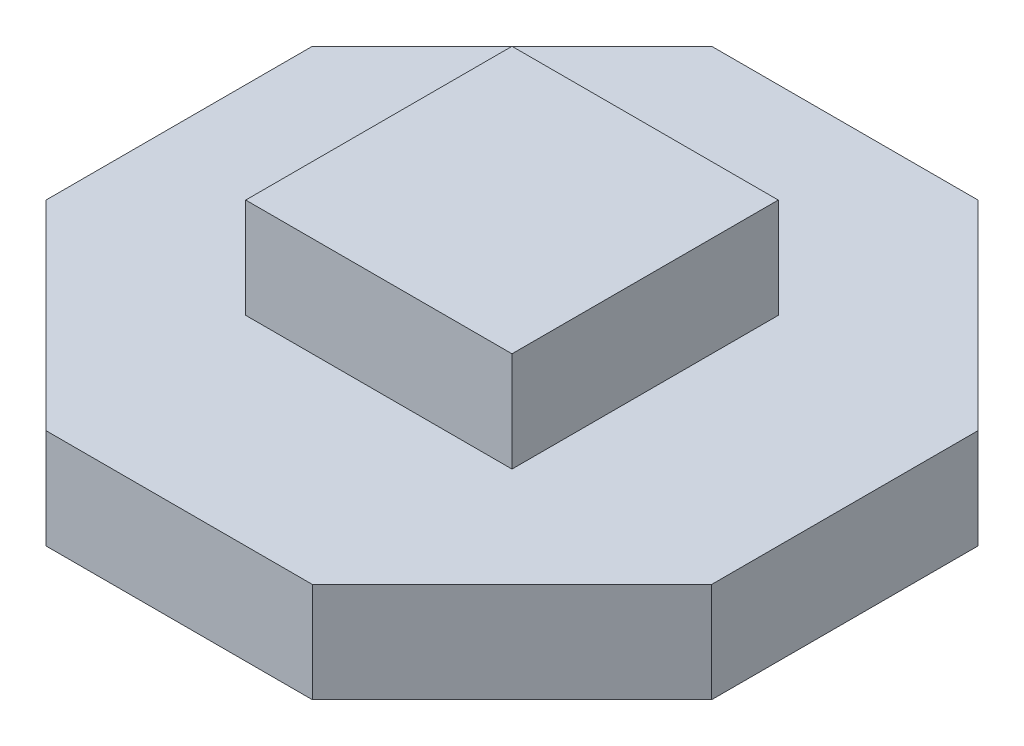
ISO-10303-21;
HEADER;
FILE_DESCRIPTION(('STEP AP214'),'2;1');
FILE_NAME('part.step','',(''),(''),'','','');
FILE_SCHEMA(('AUTOMOTIVE_DESIGN { 1 0 10303 214 1 1 1 1 }'));
ENDSEC;
DATA;
#1=APPLICATION_CONTEXT('core data for automotive mechanical design processes');
#2=APPLICATION_PROTOCOL_DEFINITION('international standard','automotive_design',2000,#1);
#3=PRODUCT_CONTEXT('',#1,'mechanical');
#4=PRODUCT('Part','Part','',(#3));
#5=PRODUCT_RELATED_PRODUCT_CATEGORY('part','',(#4));
#6=PRODUCT_DEFINITION_FORMATION('','',#4);
#7=PRODUCT_DEFINITION_CONTEXT('part definition',#1,'design');
#8=PRODUCT_DEFINITION('design','',#6,#7);
#9=PRODUCT_DEFINITION_SHAPE('','',#8);
#10=(LENGTH_UNIT() NAMED_UNIT(*) SI_UNIT(.MILLI.,.METRE.));
#11=(NAMED_UNIT(*) PLANE_ANGLE_UNIT() SI_UNIT($,.RADIAN.));
#12=(NAMED_UNIT(*) SI_UNIT($,.STERADIAN.) SOLID_ANGLE_UNIT());
#13=UNCERTAINTY_MEASURE_WITH_UNIT(LENGTH_MEASURE(1.E-05),#10,'distance_accuracy_value','');
#14=(GEOMETRIC_REPRESENTATION_CONTEXT(3) GLOBAL_UNCERTAINTY_ASSIGNED_CONTEXT((#13)) GLOBAL_UNIT_ASSIGNED_CONTEXT((#10,
#11,#12)) REPRESENTATION_CONTEXT('',''));
#15=CARTESIAN_POINT('',(0.,0.,0.));
#16=DIRECTION('',(0.,0.,1.));
#17=DIRECTION('',(1.,0.,0.));
#18=AXIS2_PLACEMENT_3D('',#15,#16,#17);
#19=CARTESIAN_POINT('',(-5.,1.5,-5.));
#20=DIRECTION('',(1.,0.,0.));
#21=DIRECTION('',(0.,0.,-1.));
#22=AXIS2_PLACEMENT_3D('',#19,#20,#21);
#23=PLANE('',#22);
#24=DIRECTION('',(0.,0.,1.));
#25=VECTOR('',#24,1.);
#26=CARTESIAN_POINT('',(-5.,0.,-5.));
#27=LINE('',#26,#25);
#28=CARTESIAN_POINT('',(-5.,0.,-2.));
#29=VERTEX_POINT('',#28);
#30=CARTESIAN_POINT('',(-5.,0.,2.00000000000001));
#31=VERTEX_POINT('',#30);
#32=EDGE_CURVE('E151',#29,#31,#27,.T.);
#33=ORIENTED_EDGE('',*,*,#32,.T.);
#34=DIRECTION('',(0.,1.,0.));
#35=VECTOR('',#34,1.);
#36=CARTESIAN_POINT('',(-4.99999999999999,-0.000999999999999916,2.00000000000002));
#37=LINE('',#36,#35);
#38=CARTESIAN_POINT('',(-4.99999999999999,1.5,2.00000000000002));
#39=VERTEX_POINT('',#38);
#40=EDGE_CURVE('E131',#31,#39,#37,.T.);
#41=ORIENTED_EDGE('',*,*,#40,.T.);
#42=DIRECTION('',(0.,0.,1.));
#43=VECTOR('',#42,1.);
#44=CARTESIAN_POINT('',(-5.,1.5,-5.));
#45=LINE('',#44,#43);
#46=CARTESIAN_POINT('',(-5.,1.5,-2.));
#47=VERTEX_POINT('',#46);
#48=EDGE_CURVE('E160',#47,#39,#45,.T.);
#49=ORIENTED_EDGE('',*,*,#48,.F.);
#50=DIRECTION('',(0.,1.,0.));
#51=VECTOR('',#50,1.);
#52=CARTESIAN_POINT('',(-5.,-0.000999999999999916,-2.));
#53=LINE('',#52,#51);
#54=EDGE_CURVE('E198',#29,#47,#53,.T.);
#55=ORIENTED_EDGE('',*,*,#54,.F.);
#56=EDGE_LOOP('',(#33,#41,#49,#55));
#57=FACE_BOUND('',#56,.T.);
#58=ADVANCED_FACE('F37',(#57),#23,.F.);
#59=CARTESIAN_POINT('',(-5.,1.5,5.));
#60=DIRECTION('',(0.,0.,-1.));
#61=DIRECTION('',(-1.,0.,0.));
#62=AXIS2_PLACEMENT_3D('',#59,#60,#61);
#63=PLANE('',#62);
#64=DIRECTION('',(1.,0.,0.));
#65=VECTOR('',#64,1.);
#66=CARTESIAN_POINT('',(-5.,1.5,5.));
#67=LINE('',#66,#65);
#68=CARTESIAN_POINT('',(-1.99999999999998,1.5,5.00000000000001));
#69=VERTEX_POINT('',#68);
#70=CARTESIAN_POINT('',(2.,1.5,5.));
#71=VERTEX_POINT('',#70);
#72=EDGE_CURVE('E144',#69,#71,#67,.T.);
#73=ORIENTED_EDGE('',*,*,#72,.F.);
#74=DIRECTION('',(0.,1.,0.));
#75=VECTOR('',#74,1.);
#76=CARTESIAN_POINT('',(-1.99999999999998,-0.000999999999999916,5.00000000000001));
#77=LINE('',#76,#75);
#78=CARTESIAN_POINT('',(-1.99999999999999,0.,5.));
#79=VERTEX_POINT('',#78);
#80=EDGE_CURVE('E128',#79,#69,#77,.T.);
#81=ORIENTED_EDGE('',*,*,#80,.F.);
#82=DIRECTION('',(1.,0.,0.));
#83=VECTOR('',#82,1.);
#84=CARTESIAN_POINT('',(-5.,0.,5.));
#85=LINE('',#84,#83);
#86=CARTESIAN_POINT('',(2.,0.,5.));
#87=VERTEX_POINT('',#86);
#88=EDGE_CURVE('E142',#79,#87,#85,.T.);
#89=ORIENTED_EDGE('',*,*,#88,.T.);
#90=DIRECTION('',(0.,1.,0.));
#91=VECTOR('',#90,1.);
#92=CARTESIAN_POINT('',(2.,-0.000999999999999916,5.));
#93=LINE('',#92,#91);
#94=EDGE_CURVE('E53',#87,#71,#93,.T.);
#95=ORIENTED_EDGE('',*,*,#94,.T.);
#96=EDGE_LOOP('',(#73,#81,#89,#95));
#97=FACE_BOUND('',#96,.T.);
#98=ADVANCED_FACE('F141',(#97),#63,.F.);
#99=CARTESIAN_POINT('',(5.,1.5,-5.));
#100=DIRECTION('',(-1.,0.,0.));
#101=DIRECTION('',(0.,0.,1.));
#102=AXIS2_PLACEMENT_3D('',#99,#100,#101);
#103=PLANE('',#102);
#104=DIRECTION('',(0.,0.,-1.));
#105=VECTOR('',#104,1.);
#106=CARTESIAN_POINT('',(5.,1.5,-5.));
#107=LINE('',#106,#105);
#108=CARTESIAN_POINT('',(5.,1.5,2.));
#109=VERTEX_POINT('',#108);
#110=CARTESIAN_POINT('',(4.99999999999998,1.5,-2.00000000000005));
#111=VERTEX_POINT('',#110);
#112=EDGE_CURVE('E45',#109,#111,#107,.T.);
#113=ORIENTED_EDGE('',*,*,#112,.F.);
#114=DIRECTION('',(0.,1.,0.));
#115=VECTOR('',#114,1.);
#116=CARTESIAN_POINT('',(5.,-0.000999999999999916,2.));
#117=LINE('',#116,#115);
#118=CARTESIAN_POINT('',(5.,0.,2.));
#119=VERTEX_POINT('',#118);
#120=EDGE_CURVE('E213',#119,#109,#117,.T.);
#121=ORIENTED_EDGE('',*,*,#120,.F.);
#122=DIRECTION('',(0.,0.,-1.));
#123=VECTOR('',#122,1.);
#124=CARTESIAN_POINT('',(5.,0.,-5.));
#125=LINE('',#124,#123);
#126=CARTESIAN_POINT('',(5.,0.,-2.00000000000003));
#127=VERTEX_POINT('',#126);
#128=EDGE_CURVE('E150',#119,#127,#125,.T.);
#129=ORIENTED_EDGE('',*,*,#128,.T.);
#130=DIRECTION('',(0.,1.,0.));
#131=VECTOR('',#130,1.);
#132=CARTESIAN_POINT('',(4.99999999999998,-0.000999999999999916,-2.00000000000005));
#133=LINE('',#132,#131);
#134=EDGE_CURVE('E61',#127,#111,#133,.T.);
#135=ORIENTED_EDGE('',*,*,#134,.T.);
#136=EDGE_LOOP('',(#113,#121,#129,#135));
#137=FACE_BOUND('',#136,.T.);
#138=ADVANCED_FACE('F238',(#137),#103,.F.);
#139=CARTESIAN_POINT('',(-5.,1.5,-5.));
#140=DIRECTION('',(0.,0.,1.));
#141=DIRECTION('',(1.,0.,0.));
#142=AXIS2_PLACEMENT_3D('',#139,#140,#141);
#143=PLANE('',#142);
#144=DIRECTION('',(-1.,0.,0.));
#145=VECTOR('',#144,1.);
#146=CARTESIAN_POINT('',(-5.,1.5,-5.));
#147=LINE('',#146,#145);
#148=CARTESIAN_POINT('',(1.99999999999995,1.5,-5.00000000000002));
#149=VERTEX_POINT('',#148);
#150=CARTESIAN_POINT('',(-2.,1.5,-5.));
#151=VERTEX_POINT('',#150);
#152=EDGE_CURVE('E11',#149,#151,#147,.T.);
#153=ORIENTED_EDGE('',*,*,#152,.F.);
#154=DIRECTION('',(0.,1.,0.));
#155=VECTOR('',#154,1.);
#156=CARTESIAN_POINT('',(1.99999999999995,-0.000999999999999916,-5.00000000000002));
#157=LINE('',#156,#155);
#158=CARTESIAN_POINT('',(1.99999999999997,0.,-5.));
#159=VERTEX_POINT('',#158);
#160=EDGE_CURVE('E207',#159,#149,#157,.T.);
#161=ORIENTED_EDGE('',*,*,#160,.F.);
#162=DIRECTION('',(-1.,0.,0.));
#163=VECTOR('',#162,1.);
#164=CARTESIAN_POINT('',(-5.,0.,-5.));
#165=LINE('',#164,#163);
#166=CARTESIAN_POINT('',(-2.,0.,-5.));
#167=VERTEX_POINT('',#166);
#168=EDGE_CURVE('E40',#159,#167,#165,.T.);
#169=ORIENTED_EDGE('',*,*,#168,.T.);
#170=DIRECTION('',(0.,1.,0.));
#171=VECTOR('',#170,1.);
#172=CARTESIAN_POINT('',(-2.,-0.000999999999999916,-5.));
#173=LINE('',#172,#171);
#174=EDGE_CURVE('E197',#167,#151,#173,.T.);
#175=ORIENTED_EDGE('',*,*,#174,.T.);
#176=EDGE_LOOP('',(#153,#161,#169,#175));
#177=FACE_BOUND('',#176,.T.);
#178=ADVANCED_FACE('F232',(#177),#143,.F.);
#179=CARTESIAN_POINT('',(0.,1.5,0.));
#180=DIRECTION('',(0.,1.,0.));
#181=DIRECTION('',(0.,0.,1.));
#182=AXIS2_PLACEMENT_3D('',#179,#180,#181);
#183=PLANE('',#182);
#184=DIRECTION('',(-0.70710678118655,0.,-0.707106781186545));
#185=VECTOR('',#184,1.);
#186=CARTESIAN_POINT('',(-1.99999999999998,1.5,5.00000000000001));
#187=LINE('',#186,#185);
#188=EDGE_CURVE('E145',#69,#39,#187,.T.);
#189=ORIENTED_EDGE('',*,*,#188,.F.);
#190=ORIENTED_EDGE('',*,*,#72,.T.);
#191=DIRECTION('',(-0.707106781186548,0.,0.707106781186548));
#192=VECTOR('',#191,1.);
#193=CARTESIAN_POINT('',(5.,1.5,2.));
#194=LINE('',#193,#192);
#195=EDGE_CURVE('E206',#109,#71,#194,.T.);
#196=ORIENTED_EDGE('',*,*,#195,.F.);
#197=ORIENTED_EDGE('',*,*,#112,.T.);
#198=DIRECTION('',(0.707106781186555,0.,0.70710678118654));
#199=VECTOR('',#198,1.);
#200=CARTESIAN_POINT('',(1.99999999999995,1.5,-5.00000000000002));
#201=LINE('',#200,#199);
#202=EDGE_CURVE('E209',#149,#111,#201,.T.);
#203=ORIENTED_EDGE('',*,*,#202,.F.);
#204=ORIENTED_EDGE('',*,*,#152,.T.);
#205=DIRECTION('',(0.707106781186548,0.,-0.707106781186548));
#206=VECTOR('',#205,1.);
#207=CARTESIAN_POINT('',(-5.,1.5,-2.));
#208=LINE('',#207,#206);
#209=EDGE_CURVE('E136',#47,#151,#208,.T.);
#210=ORIENTED_EDGE('',*,*,#209,.F.);
#211=ORIENTED_EDGE('',*,*,#48,.T.);
#212=EDGE_LOOP('',(#189,#190,#196,#197,#203,#204,#210,#211));
#213=FACE_BOUND('',#212,.T.);
#214=DIRECTION('',(0.,0.,1.));
#215=VECTOR('',#214,1.);
#216=CARTESIAN_POINT('',(-2.,1.5,-2.));
#217=LINE('',#216,#215);
#218=CARTESIAN_POINT('',(-2.,1.5,-2.));
#219=VERTEX_POINT('',#218);
#220=CARTESIAN_POINT('',(-2.,1.5,2.));
#221=VERTEX_POINT('',#220);
#222=EDGE_CURVE('E185',#219,#221,#217,.T.);
#223=ORIENTED_EDGE('',*,*,#222,.F.);
#224=DIRECTION('',(-1.,0.,0.));
#225=VECTOR('',#224,1.);
#226=CARTESIAN_POINT('',(-2.,1.5,-2.));
#227=LINE('',#226,#225);
#228=CARTESIAN_POINT('',(2.,1.5,-2.));
#229=VERTEX_POINT('',#228);
#230=EDGE_CURVE('E175',#229,#219,#227,.T.);
#231=ORIENTED_EDGE('',*,*,#230,.F.);
#232=DIRECTION('',(0.,0.,-1.));
#233=VECTOR('',#232,1.);
#234=CARTESIAN_POINT('',(2.,1.5,-2.));
#235=LINE('',#234,#233);
#236=CARTESIAN_POINT('',(2.,1.5,2.));
#237=VERTEX_POINT('',#236);
#238=EDGE_CURVE('E179',#237,#229,#235,.T.);
#239=ORIENTED_EDGE('',*,*,#238,.F.);
#240=DIRECTION('',(1.,0.,0.));
#241=VECTOR('',#240,1.);
#242=CARTESIAN_POINT('',(-2.,1.5,2.));
#243=LINE('',#242,#241);
#244=EDGE_CURVE('E182',#221,#237,#243,.T.);
#245=ORIENTED_EDGE('',*,*,#244,.F.);
#246=EDGE_LOOP('',(#223,#231,#239,#245));
#247=FACE_BOUND('',#246,.T.);
#248=ADVANCED_FACE('F223',(#213,#247),#183,.T.);
#249=CARTESIAN_POINT('',(0.,0.,0.));
#250=DIRECTION('',(0.,1.,0.));
#251=DIRECTION('',(0.,0.,1.));
#252=AXIS2_PLACEMENT_3D('',#249,#250,#251);
#253=PLANE('',#252);
#254=ORIENTED_EDGE('',*,*,#88,.F.);
#255=DIRECTION('',(0.70710678118655,0.,0.707106781186545));
#256=VECTOR('',#255,1.);
#257=CARTESIAN_POINT('',(-1.99999999999998,0.,5.00000000000001));
#258=LINE('',#257,#256);
#259=EDGE_CURVE('E125',#31,#79,#258,.T.);
#260=ORIENTED_EDGE('',*,*,#259,.F.);
#261=ORIENTED_EDGE('',*,*,#32,.F.);
#262=DIRECTION('',(-0.707106781186548,0.,0.707106781186548));
#263=VECTOR('',#262,1.);
#264=CARTESIAN_POINT('',(-5.,0.,-2.));
#265=LINE('',#264,#263);
#266=EDGE_CURVE('E188',#167,#29,#265,.T.);
#267=ORIENTED_EDGE('',*,*,#266,.F.);
#268=ORIENTED_EDGE('',*,*,#168,.F.);
#269=DIRECTION('',(-0.707106781186555,0.,-0.70710678118654));
#270=VECTOR('',#269,1.);
#271=CARTESIAN_POINT('',(1.99999999999995,0.,-5.00000000000002));
#272=LINE('',#271,#270);
#273=EDGE_CURVE('E204',#127,#159,#272,.T.);
#274=ORIENTED_EDGE('',*,*,#273,.F.);
#275=ORIENTED_EDGE('',*,*,#128,.F.);
#276=DIRECTION('',(0.707106781186548,0.,-0.707106781186548));
#277=VECTOR('',#276,1.);
#278=CARTESIAN_POINT('',(5.,0.,2.));
#279=LINE('',#278,#277);
#280=EDGE_CURVE('E149',#87,#119,#279,.T.);
#281=ORIENTED_EDGE('',*,*,#280,.F.);
#282=EDGE_LOOP('',(#254,#260,#261,#267,#268,#274,#275,#281));
#283=FACE_BOUND('',#282,.T.);
#284=ADVANCED_FACE('F147',(#283),#253,.F.);
#285=CARTESIAN_POINT('',(-2.,3.,-2.));
#286=DIRECTION('',(1.,0.,0.));
#287=DIRECTION('',(0.,0.,-1.));
#288=AXIS2_PLACEMENT_3D('',#285,#286,#287);
#289=PLANE('',#288);
#290=ORIENTED_EDGE('',*,*,#222,.T.);
#291=DIRECTION('',(0.,-1.,0.));
#292=VECTOR('',#291,1.);
#293=CARTESIAN_POINT('',(-2.,3.,2.));
#294=LINE('',#293,#292);
#295=CARTESIAN_POINT('',(-2.,3.,2.));
#296=VERTEX_POINT('',#295);
#297=EDGE_CURVE('E154',#296,#221,#294,.T.);
#298=ORIENTED_EDGE('',*,*,#297,.F.);
#299=DIRECTION('',(0.,0.,1.));
#300=VECTOR('',#299,1.);
#301=CARTESIAN_POINT('',(-2.,3.,-2.));
#302=LINE('',#301,#300);
#303=CARTESIAN_POINT('',(-2.,3.,-2.));
#304=VERTEX_POINT('',#303);
#305=EDGE_CURVE('E178',#304,#296,#302,.T.);
#306=ORIENTED_EDGE('',*,*,#305,.F.);
#307=DIRECTION('',(0.,-1.,0.));
#308=VECTOR('',#307,1.);
#309=CARTESIAN_POINT('',(-2.,3.,-2.));
#310=LINE('',#309,#308);
#311=EDGE_CURVE('E171',#304,#219,#310,.T.);
#312=ORIENTED_EDGE('',*,*,#311,.T.);
#313=EDGE_LOOP('',(#290,#298,#306,#312));
#314=FACE_BOUND('',#313,.T.);
#315=ADVANCED_FACE('F264',(#314),#289,.F.);
#316=CARTESIAN_POINT('',(-2.,3.,2.));
#317=DIRECTION('',(0.,0.,-1.));
#318=DIRECTION('',(-1.,0.,0.));
#319=AXIS2_PLACEMENT_3D('',#316,#317,#318);
#320=PLANE('',#319);
#321=ORIENTED_EDGE('',*,*,#244,.T.);
#322=DIRECTION('',(0.,-1.,0.));
#323=VECTOR('',#322,1.);
#324=CARTESIAN_POINT('',(2.,3.,2.));
#325=LINE('',#324,#323);
#326=CARTESIAN_POINT('',(2.,3.,2.));
#327=VERTEX_POINT('',#326);
#328=EDGE_CURVE('E165',#327,#237,#325,.T.);
#329=ORIENTED_EDGE('',*,*,#328,.F.);
#330=DIRECTION('',(1.,0.,0.));
#331=VECTOR('',#330,1.);
#332=CARTESIAN_POINT('',(-2.,3.,2.));
#333=LINE('',#332,#331);
#334=EDGE_CURVE('E192',#296,#327,#333,.T.);
#335=ORIENTED_EDGE('',*,*,#334,.F.);
#336=ORIENTED_EDGE('',*,*,#297,.T.);
#337=EDGE_LOOP('',(#321,#329,#335,#336));
#338=FACE_BOUND('',#337,.T.);
#339=ADVANCED_FACE('F269',(#338),#320,.F.);
#340=CARTESIAN_POINT('',(2.,3.,-2.));
#341=DIRECTION('',(-1.,0.,0.));
#342=DIRECTION('',(0.,0.,1.));
#343=AXIS2_PLACEMENT_3D('',#340,#341,#342);
#344=PLANE('',#343);
#345=ORIENTED_EDGE('',*,*,#238,.T.);
#346=DIRECTION('',(0.,-1.,0.));
#347=VECTOR('',#346,1.);
#348=CARTESIAN_POINT('',(2.,3.,-2.));
#349=LINE('',#348,#347);
#350=CARTESIAN_POINT('',(2.,3.,-2.));
#351=VERTEX_POINT('',#350);
#352=EDGE_CURVE('E168',#351,#229,#349,.T.);
#353=ORIENTED_EDGE('',*,*,#352,.F.);
#354=DIRECTION('',(0.,0.,-1.));
#355=VECTOR('',#354,1.);
#356=CARTESIAN_POINT('',(2.,3.,-2.));
#357=LINE('',#356,#355);
#358=EDGE_CURVE('E190',#327,#351,#357,.T.);
#359=ORIENTED_EDGE('',*,*,#358,.F.);
#360=ORIENTED_EDGE('',*,*,#328,.T.);
#361=EDGE_LOOP('',(#345,#353,#359,#360));
#362=FACE_BOUND('',#361,.T.);
#363=ADVANCED_FACE('F273',(#362),#344,.F.);
#364=CARTESIAN_POINT('',(-2.,3.,-2.));
#365=DIRECTION('',(0.,0.,1.));
#366=DIRECTION('',(1.,0.,0.));
#367=AXIS2_PLACEMENT_3D('',#364,#365,#366);
#368=PLANE('',#367);
#369=ORIENTED_EDGE('',*,*,#230,.T.);
#370=ORIENTED_EDGE('',*,*,#311,.F.);
#371=DIRECTION('',(-1.,0.,0.));
#372=VECTOR('',#371,1.);
#373=CARTESIAN_POINT('',(-2.,3.,-2.));
#374=LINE('',#373,#372);
#375=EDGE_CURVE('E174',#351,#304,#374,.T.);
#376=ORIENTED_EDGE('',*,*,#375,.F.);
#377=ORIENTED_EDGE('',*,*,#352,.T.);
#378=EDGE_LOOP('',(#369,#370,#376,#377));
#379=FACE_BOUND('',#378,.T.);
#380=ADVANCED_FACE('F277',(#379),#368,.F.);
#381=CARTESIAN_POINT('',(0.,3.,0.));
#382=DIRECTION('',(0.,1.,0.));
#383=DIRECTION('',(0.,0.,1.));
#384=AXIS2_PLACEMENT_3D('',#381,#382,#383);
#385=PLANE('',#384);
#386=ORIENTED_EDGE('',*,*,#305,.T.);
#387=ORIENTED_EDGE('',*,*,#334,.T.);
#388=ORIENTED_EDGE('',*,*,#358,.T.);
#389=ORIENTED_EDGE('',*,*,#375,.T.);
#390=EDGE_LOOP('',(#386,#387,#388,#389));
#391=FACE_BOUND('',#390,.T.);
#392=ADVANCED_FACE('F249',(#391),#385,.T.);
#393=CARTESIAN_POINT('',(-5.,-0.000999999999999916,-2.));
#394=DIRECTION('',(0.707106781186548,0.,0.707106781186548));
#395=DIRECTION('',(0.707106781186548,0.,-0.707106781186548));
#396=AXIS2_PLACEMENT_3D('',#393,#394,#395);
#397=PLANE('',#396);
#398=ORIENTED_EDGE('',*,*,#266,.T.);
#399=ORIENTED_EDGE('',*,*,#54,.T.);
#400=ORIENTED_EDGE('',*,*,#209,.T.);
#401=ORIENTED_EDGE('',*,*,#174,.F.);
#402=EDGE_LOOP('',(#398,#399,#400,#401));
#403=FACE_BOUND('',#402,.T.);
#404=ADVANCED_FACE('F229',(#403),#397,.F.);
#405=CARTESIAN_POINT('',(1.99999999999995,-0.000999999999999916,-5.00000000000002));
#406=DIRECTION('',(-0.70710678118654,0.,0.707106781186555));
#407=DIRECTION('',(0.707106781186555,0.,0.70710678118654));
#408=AXIS2_PLACEMENT_3D('',#405,#406,#407);
#409=PLANE('',#408);
#410=ORIENTED_EDGE('',*,*,#273,.T.);
#411=ORIENTED_EDGE('',*,*,#160,.T.);
#412=ORIENTED_EDGE('',*,*,#202,.T.);
#413=ORIENTED_EDGE('',*,*,#134,.F.);
#414=EDGE_LOOP('',(#410,#411,#412,#413));
#415=FACE_BOUND('',#414,.T.);
#416=ADVANCED_FACE('F241',(#415),#409,.F.);
#417=CARTESIAN_POINT('',(5.,-0.000999999999999916,2.));
#418=DIRECTION('',(-0.707106781186548,0.,-0.707106781186548));
#419=DIRECTION('',(-0.707106781186548,0.,0.707106781186548));
#420=AXIS2_PLACEMENT_3D('',#417,#418,#419);
#421=PLANE('',#420);
#422=ORIENTED_EDGE('',*,*,#280,.T.);
#423=ORIENTED_EDGE('',*,*,#120,.T.);
#424=ORIENTED_EDGE('',*,*,#195,.T.);
#425=ORIENTED_EDGE('',*,*,#94,.F.);
#426=EDGE_LOOP('',(#422,#423,#424,#425));
#427=FACE_BOUND('',#426,.T.);
#428=ADVANCED_FACE('F240',(#427),#421,.F.);
#429=CARTESIAN_POINT('',(-1.99999999999998,-0.000999999999999916,5.00000000000001));
#430=DIRECTION('',(0.707106781186545,0.,-0.70710678118655));
#431=DIRECTION('',(-0.70710678118655,0.,-0.707106781186545));
#432=AXIS2_PLACEMENT_3D('',#429,#430,#431);
#433=PLANE('',#432);
#434=ORIENTED_EDGE('',*,*,#259,.T.);
#435=ORIENTED_EDGE('',*,*,#80,.T.);
#436=ORIENTED_EDGE('',*,*,#188,.T.);
#437=ORIENTED_EDGE('',*,*,#40,.F.);
#438=EDGE_LOOP('',(#434,#435,#436,#437));
#439=FACE_BOUND('',#438,.T.);
#440=ADVANCED_FACE('F127',(#439),#433,.F.);
#441=CLOSED_SHELL('',(#58,#98,#138,#178,#248,#284,#315,#339,#363,#380,#392,#404,#416,#428,#440));
#442=MANIFOLD_SOLID_BREP('B2',#441);
#443=ADVANCED_BREP_SHAPE_REPRESENTATION('',(#18,#442),#14);
#444=SHAPE_DEFINITION_REPRESENTATION(#9,#443);
ENDSEC;
END-ISO-10303-21;
